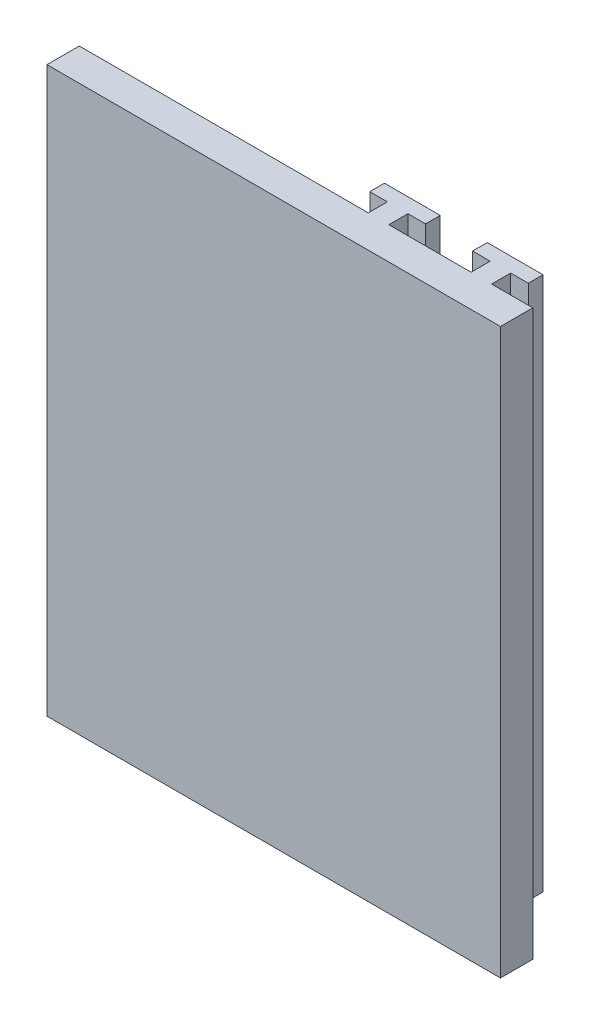
ISO-10303-21;
HEADER;
FILE_DESCRIPTION(('STEP AP214'),'2;1');
FILE_NAME('part.step','',(''),(''),'','','');
FILE_SCHEMA(('AUTOMOTIVE_DESIGN { 1 0 10303 214 1 1 1 1 }'));
ENDSEC;
DATA;
#1=APPLICATION_CONTEXT('core data for automotive mechanical design processes');
#2=APPLICATION_PROTOCOL_DEFINITION('international standard','automotive_design',2000,#1);
#3=PRODUCT_CONTEXT('',#1,'mechanical');
#4=PRODUCT('Part','Part','',(#3));
#5=PRODUCT_RELATED_PRODUCT_CATEGORY('part','',(#4));
#6=PRODUCT_DEFINITION_FORMATION('','',#4);
#7=PRODUCT_DEFINITION_CONTEXT('part definition',#1,'design');
#8=PRODUCT_DEFINITION('design','',#6,#7);
#9=PRODUCT_DEFINITION_SHAPE('','',#8);
#10=(LENGTH_UNIT() NAMED_UNIT(*) SI_UNIT(.MILLI.,.METRE.));
#11=(NAMED_UNIT(*) PLANE_ANGLE_UNIT() SI_UNIT($,.RADIAN.));
#12=(NAMED_UNIT(*) SI_UNIT($,.STERADIAN.) SOLID_ANGLE_UNIT());
#13=UNCERTAINTY_MEASURE_WITH_UNIT(LENGTH_MEASURE(1.E-05),#10,'distance_accuracy_value','');
#14=(GEOMETRIC_REPRESENTATION_CONTEXT(3) GLOBAL_UNCERTAINTY_ASSIGNED_CONTEXT((#13)) GLOBAL_UNIT_ASSIGNED_CONTEXT((#10,
#11,#12)) REPRESENTATION_CONTEXT('',''));
#15=CARTESIAN_POINT('',(0.,0.,0.));
#16=DIRECTION('',(0.,0.,1.));
#17=DIRECTION('',(1.,0.,0.));
#18=AXIS2_PLACEMENT_3D('',#15,#16,#17);
#19=CARTESIAN_POINT('',(0.,0.,133.));
#20=DIRECTION('',(0.,0.,-1.));
#21=DIRECTION('',(-1.,0.,0.));
#22=AXIS2_PLACEMENT_3D('',#19,#20,#21);
#23=PLANE('',#22);
#24=DIRECTION('',(0.,-1.,0.));
#25=VECTOR('',#24,1.);
#26=CARTESIAN_POINT('',(-80.2435786715828,0.,133.));
#27=LINE('',#26,#25);
#28=CARTESIAN_POINT('',(-80.2435786715828,41.7965995852405,133.));
#29=VERTEX_POINT('',#28);
#30=CARTESIAN_POINT('',(-80.2435786715828,-54.2534584342839,133.));
#31=VERTEX_POINT('',#30);
#32=EDGE_CURVE('E50',#29,#31,#27,.T.);
#33=ORIENTED_EDGE('',*,*,#32,.F.);
#34=DIRECTION('',(-1.,0.,0.));
#35=VECTOR('',#34,1.);
#36=CARTESIAN_POINT('',(-3.04970902650446,41.7965995852406,133.));
#37=LINE('',#36,#35);
#38=CARTESIAN_POINT('',(-31.0471979670366,41.7965995852406,133.));
#39=VERTEX_POINT('',#38);
#40=EDGE_CURVE('E320',#39,#29,#37,.T.);
#41=ORIENTED_EDGE('',*,*,#40,.F.);
#42=DIRECTION('',(0.,1.,0.));
#43=VECTOR('',#42,1.);
#44=CARTESIAN_POINT('',(-31.0471979670366,-60.3037204534745,133.));
#45=LINE('',#44,#43);
#46=CARTESIAN_POINT('',(-31.0471979670366,-49.2034004147594,133.));
#47=VERTEX_POINT('',#46);
#48=EDGE_CURVE('E219',#47,#39,#45,.T.);
#49=ORIENTED_EDGE('',*,*,#48,.F.);
#50=DIRECTION('',(1.,0.,0.));
#51=VECTOR('',#50,1.);
#52=CARTESIAN_POINT('',(-31.0471979670366,-49.2034004147594,133.));
#53=LINE('',#52,#51);
#54=CARTESIAN_POINT('',(-27.5522200859723,-49.2034004147594,133.));
#55=VERTEX_POINT('',#54);
#56=EDGE_CURVE('E215',#47,#55,#53,.T.);
#57=ORIENTED_EDGE('',*,*,#56,.T.);
#58=DIRECTION('',(0.,1.,0.));
#59=VECTOR('',#58,1.);
#60=CARTESIAN_POINT('',(-27.5522200859723,-60.3037204534745,133.));
#61=LINE('',#60,#59);
#62=CARTESIAN_POINT('',(-27.5522200859723,41.7965995852406,133.));
#63=VERTEX_POINT('',#62);
#64=EDGE_CURVE('E218',#55,#63,#61,.T.);
#65=ORIENTED_EDGE('',*,*,#64,.T.);
#66=CARTESIAN_POINT('',(-13.5471979670366,41.7965995852406,133.));
#67=VERTEX_POINT('',#66);
#68=EDGE_CURVE('E323',#67,#63,#37,.T.);
#69=ORIENTED_EDGE('',*,*,#68,.F.);
#70=DIRECTION('',(0.,1.,0.));
#71=VECTOR('',#70,1.);
#72=CARTESIAN_POINT('',(-13.5471979670366,-60.3037204534745,133.));
#73=LINE('',#72,#71);
#74=CARTESIAN_POINT('',(-13.5471979670366,-49.2034004147594,133.));
#75=VERTEX_POINT('',#74);
#76=EDGE_CURVE('E282',#75,#67,#73,.T.);
#77=ORIENTED_EDGE('',*,*,#76,.F.);
#78=DIRECTION('',(1.,0.,0.));
#79=VECTOR('',#78,1.);
#80=CARTESIAN_POINT('',(-13.5471979670366,-49.2034004147594,133.));
#81=LINE('',#80,#79);
#82=CARTESIAN_POINT('',(-10.0522200859723,-49.2034004147594,133.));
#83=VERTEX_POINT('',#82);
#84=EDGE_CURVE('E278',#75,#83,#81,.T.);
#85=ORIENTED_EDGE('',*,*,#84,.T.);
#86=DIRECTION('',(0.,1.,0.));
#87=VECTOR('',#86,1.);
#88=CARTESIAN_POINT('',(-10.0522200859723,-60.3037204534745,133.));
#89=LINE('',#88,#87);
#90=CARTESIAN_POINT('',(-10.0522200859723,41.7965995852406,133.));
#91=VERTEX_POINT('',#90);
#92=EDGE_CURVE('E281',#83,#91,#89,.T.);
#93=ORIENTED_EDGE('',*,*,#92,.T.);
#94=CARTESIAN_POINT('',(-3.04970902650446,41.7965995852406,133.));
#95=VERTEX_POINT('',#94);
#96=EDGE_CURVE('E321',#95,#91,#37,.T.);
#97=ORIENTED_EDGE('',*,*,#96,.F.);
#98=DIRECTION('',(0.,1.,0.));
#99=VECTOR('',#98,1.);
#100=CARTESIAN_POINT('',(-3.04970902650446,41.7965995852406,133.));
#101=LINE('',#100,#99);
#102=CARTESIAN_POINT('',(-3.04970902650447,-54.2534584342839,133.));
#103=VERTEX_POINT('',#102);
#104=EDGE_CURVE('E315',#103,#95,#101,.T.);
#105=ORIENTED_EDGE('',*,*,#104,.F.);
#106=DIRECTION('',(1.,0.,0.));
#107=VECTOR('',#106,1.);
#108=CARTESIAN_POINT('',(0.,-54.2534584342839,133.));
#109=LINE('',#108,#107);
#110=EDGE_CURVE('E185',#31,#103,#109,.T.);
#111=ORIENTED_EDGE('',*,*,#110,.F.);
#112=EDGE_LOOP('',(#33,#41,#49,#57,#65,#69,#77,#85,#93,#97,#105,#111));
#113=FACE_BOUND('',#112,.T.);
#114=ADVANCED_FACE('F35',(#113),#23,.T.);
#115=CARTESIAN_POINT('',(-3.04970902650446,41.7965995852406,322.890889145858));
#116=DIRECTION('',(0.,-1.,0.));
#117=DIRECTION('',(1.,0.,0.));
#118=AXIS2_PLACEMENT_3D('',#115,#116,#117);
#119=PLANE('',#118);
#120=ORIENTED_EDGE('',*,*,#40,.T.);
#121=DIRECTION('',(0.,0.,1.));
#122=VECTOR('',#121,1.);
#123=CARTESIAN_POINT('',(-80.2435786715828,41.7965995852405,127.25));
#124=LINE('',#123,#122);
#125=CARTESIAN_POINT('',(-80.2435786715828,41.7965995852405,138.5));
#126=VERTEX_POINT('',#125);
#127=EDGE_CURVE('E181',#29,#126,#124,.T.);
#128=ORIENTED_EDGE('',*,*,#127,.T.);
#129=DIRECTION('',(1.,0.,0.));
#130=VECTOR('',#129,1.);
#131=CARTESIAN_POINT('',(-3.04970902650446,41.7965995852406,138.5));
#132=LINE('',#131,#130);
#133=CARTESIAN_POINT('',(-3.04970902650446,41.7965995852406,138.5));
#134=VERTEX_POINT('',#133);
#135=EDGE_CURVE('E180',#126,#134,#132,.T.);
#136=ORIENTED_EDGE('',*,*,#135,.T.);
#137=DIRECTION('',(0.,0.,-1.));
#138=VECTOR('',#137,1.);
#139=CARTESIAN_POINT('',(-3.04970902650446,41.7965995852406,322.890889145858));
#140=LINE('',#139,#138);
#141=EDGE_CURVE('E317',#134,#95,#140,.T.);
#142=ORIENTED_EDGE('',*,*,#141,.T.);
#143=ORIENTED_EDGE('',*,*,#96,.T.);
#144=DIRECTION('',(0.,0.,-1.));
#145=VECTOR('',#144,1.);
#146=CARTESIAN_POINT('',(-10.0522200859723,41.7965995852406,133.));
#147=LINE('',#146,#145);
#148=CARTESIAN_POINT('',(-10.0522200859723,41.7965995852406,129.75));
#149=VERTEX_POINT('',#148);
#150=EDGE_CURVE('E253',#91,#149,#147,.T.);
#151=ORIENTED_EDGE('',*,*,#150,.T.);
#152=DIRECTION('',(1.,0.,0.));
#153=VECTOR('',#152,1.);
#154=CARTESIAN_POINT('',(-10.0522200859723,41.7965995852406,129.75));
#155=LINE('',#154,#153);
#156=CARTESIAN_POINT('',(-7.05222008597235,41.7965995852406,129.75));
#157=VERTEX_POINT('',#156);
#158=EDGE_CURVE('E270',#149,#157,#155,.T.);
#159=ORIENTED_EDGE('',*,*,#158,.T.);
#160=DIRECTION('',(0.,0.,-1.));
#161=VECTOR('',#160,1.);
#162=CARTESIAN_POINT('',(-7.05222008597235,41.7965995852406,129.75));
#163=LINE('',#162,#161);
#164=CARTESIAN_POINT('',(-7.05222008597235,41.7965995852406,127.25));
#165=VERTEX_POINT('',#164);
#166=EDGE_CURVE('E267',#157,#165,#163,.T.);
#167=ORIENTED_EDGE('',*,*,#166,.T.);
#168=DIRECTION('',(-1.,0.,0.));
#169=VECTOR('',#168,1.);
#170=CARTESIAN_POINT('',(-7.05222008597235,41.7965995852406,127.25));
#171=LINE('',#170,#169);
#172=CARTESIAN_POINT('',(-16.5471979670366,41.7965995852406,127.25));
#173=VERTEX_POINT('',#172);
#174=EDGE_CURVE('E264',#165,#173,#171,.T.);
#175=ORIENTED_EDGE('',*,*,#174,.T.);
#176=DIRECTION('',(0.,0.,1.));
#177=VECTOR('',#176,1.);
#178=CARTESIAN_POINT('',(-16.5471979670366,41.7965995852406,127.25));
#179=LINE('',#178,#177);
#180=CARTESIAN_POINT('',(-16.5471979670366,41.7965995852406,129.75));
#181=VERTEX_POINT('',#180);
#182=EDGE_CURVE('E261',#173,#181,#179,.T.);
#183=ORIENTED_EDGE('',*,*,#182,.T.);
#184=DIRECTION('',(1.,0.,0.));
#185=VECTOR('',#184,1.);
#186=CARTESIAN_POINT('',(-16.5471979670366,41.7965995852406,129.75));
#187=LINE('',#186,#185);
#188=CARTESIAN_POINT('',(-13.5471979670366,41.7965995852406,129.75));
#189=VERTEX_POINT('',#188);
#190=EDGE_CURVE('E258',#181,#189,#187,.T.);
#191=ORIENTED_EDGE('',*,*,#190,.T.);
#192=DIRECTION('',(0.,0.,1.));
#193=VECTOR('',#192,1.);
#194=CARTESIAN_POINT('',(-13.5471979670366,41.7965995852406,129.75));
#195=LINE('',#194,#193);
#196=EDGE_CURVE('E254',#189,#67,#195,.T.);
#197=ORIENTED_EDGE('',*,*,#196,.T.);
#198=ORIENTED_EDGE('',*,*,#68,.T.);
#199=DIRECTION('',(0.,0.,-1.));
#200=VECTOR('',#199,1.);
#201=CARTESIAN_POINT('',(-27.5522200859723,41.7965995852406,133.));
#202=LINE('',#201,#200);
#203=CARTESIAN_POINT('',(-27.5522200859724,41.7965995852406,129.75));
#204=VERTEX_POINT('',#203);
#205=EDGE_CURVE('E191',#63,#204,#202,.T.);
#206=ORIENTED_EDGE('',*,*,#205,.T.);
#207=DIRECTION('',(1.,0.,0.));
#208=VECTOR('',#207,1.);
#209=CARTESIAN_POINT('',(-27.5522200859724,41.7965995852406,129.75));
#210=LINE('',#209,#208);
#211=CARTESIAN_POINT('',(-24.5522200859723,41.7965995852406,129.75));
#212=VERTEX_POINT('',#211);
#213=EDGE_CURVE('E207',#204,#212,#210,.T.);
#214=ORIENTED_EDGE('',*,*,#213,.T.);
#215=DIRECTION('',(0.,0.,-1.));
#216=VECTOR('',#215,1.);
#217=CARTESIAN_POINT('',(-24.5522200859723,41.7965995852406,129.75));
#218=LINE('',#217,#216);
#219=CARTESIAN_POINT('',(-24.5522200859723,41.7965995852406,127.25));
#220=VERTEX_POINT('',#219);
#221=EDGE_CURVE('E204',#212,#220,#218,.T.);
#222=ORIENTED_EDGE('',*,*,#221,.T.);
#223=DIRECTION('',(-1.,0.,0.));
#224=VECTOR('',#223,1.);
#225=CARTESIAN_POINT('',(-24.5522200859723,41.7965995852406,127.25));
#226=LINE('',#225,#224);
#227=CARTESIAN_POINT('',(-34.0471979670366,41.7965995852406,127.25));
#228=VERTEX_POINT('',#227);
#229=EDGE_CURVE('E201',#220,#228,#226,.T.);
#230=ORIENTED_EDGE('',*,*,#229,.T.);
#231=DIRECTION('',(0.,0.,1.));
#232=VECTOR('',#231,1.);
#233=CARTESIAN_POINT('',(-34.0471979670366,41.7965995852406,127.25));
#234=LINE('',#233,#232);
#235=CARTESIAN_POINT('',(-34.0471979670366,41.7965995852406,129.75));
#236=VERTEX_POINT('',#235);
#237=EDGE_CURVE('E198',#228,#236,#234,.T.);
#238=ORIENTED_EDGE('',*,*,#237,.T.);
#239=DIRECTION('',(1.,0.,0.));
#240=VECTOR('',#239,1.);
#241=CARTESIAN_POINT('',(-34.0471979670366,41.7965995852406,129.75));
#242=LINE('',#241,#240);
#243=CARTESIAN_POINT('',(-31.0471979670366,41.7965995852406,129.75));
#244=VERTEX_POINT('',#243);
#245=EDGE_CURVE('E195',#236,#244,#242,.T.);
#246=ORIENTED_EDGE('',*,*,#245,.T.);
#247=DIRECTION('',(0.,0.,1.));
#248=VECTOR('',#247,1.);
#249=CARTESIAN_POINT('',(-31.0471979670366,41.7965995852406,129.75));
#250=LINE('',#249,#248);
#251=EDGE_CURVE('E192',#244,#39,#250,.T.);
#252=ORIENTED_EDGE('',*,*,#251,.T.);
#253=EDGE_LOOP('',(#120,#128,#136,#142,#143,#151,#159,#167,#175,#183,#191,#197,#198,#206,#214,
#222,#230,#238,#246,#252));
#254=FACE_BOUND('',#253,.T.);
#255=ADVANCED_FACE('F329',(#254),#119,.F.);
#256=CARTESIAN_POINT('',(-3.04970902650446,41.7965995852406,322.890889145858));
#257=DIRECTION('',(-1.,0.,0.));
#258=DIRECTION('',(0.,-1.,0.));
#259=AXIS2_PLACEMENT_3D('',#256,#257,#258);
#260=PLANE('',#259);
#261=DIRECTION('',(0.,-1.,0.));
#262=VECTOR('',#261,1.);
#263=CARTESIAN_POINT('',(-3.04970902650446,41.7965995852406,138.5));
#264=LINE('',#263,#262);
#265=CARTESIAN_POINT('',(-3.04970902650447,-54.2534584342839,138.5));
#266=VERTEX_POINT('',#265);
#267=EDGE_CURVE('E43',#134,#266,#264,.T.);
#268=ORIENTED_EDGE('',*,*,#267,.T.);
#269=DIRECTION('',(0.,0.,1.));
#270=VECTOR('',#269,1.);
#271=CARTESIAN_POINT('',(-3.04970902650447,-54.2534584342839,128.5));
#272=LINE('',#271,#270);
#273=EDGE_CURVE('E57',#103,#266,#272,.T.);
#274=ORIENTED_EDGE('',*,*,#273,.F.);
#275=ORIENTED_EDGE('',*,*,#104,.T.);
#276=ORIENTED_EDGE('',*,*,#141,.F.);
#277=EDGE_LOOP('',(#268,#274,#275,#276));
#278=FACE_BOUND('',#277,.T.);
#279=ADVANCED_FACE('F37',(#278),#260,.F.);
#280=CARTESIAN_POINT('',(39.9502909734955,-6.20340041475944,138.5));
#281=DIRECTION('',(0.,0.,-1.));
#282=DIRECTION('',(-1.,0.,0.));
#283=AXIS2_PLACEMENT_3D('',#280,#281,#282);
#284=PLANE('',#283);
#285=ORIENTED_EDGE('',*,*,#135,.F.);
#286=DIRECTION('',(0.,1.,0.));
#287=VECTOR('',#286,1.);
#288=CARTESIAN_POINT('',(-80.2435786715828,41.7965995852405,138.5));
#289=LINE('',#288,#287);
#290=CARTESIAN_POINT('',(-80.2435786715828,-54.2534584342839,138.5));
#291=VERTEX_POINT('',#290);
#292=EDGE_CURVE('E171',#291,#126,#289,.T.);
#293=ORIENTED_EDGE('',*,*,#292,.F.);
#294=DIRECTION('',(-1.,0.,0.));
#295=VECTOR('',#294,1.);
#296=CARTESIAN_POINT('',(-123.049709026504,-54.2534584342839,138.5));
#297=LINE('',#296,#295);
#298=EDGE_CURVE('E178',#266,#291,#297,.T.);
#299=ORIENTED_EDGE('',*,*,#298,.F.);
#300=ORIENTED_EDGE('',*,*,#267,.F.);
#301=EDGE_LOOP('',(#285,#293,#299,#300));
#302=FACE_BOUND('',#301,.T.);
#303=ADVANCED_FACE('F176',(#302),#284,.F.);
#304=CARTESIAN_POINT('',(-3.04970902650446,-49.2034004147594,123.));
#305=DIRECTION('',(0.,-1.,0.));
#306=DIRECTION('',(0.,0.,-1.));
#307=AXIS2_PLACEMENT_3D('',#304,#305,#306);
#308=PLANE('',#307);
#309=ORIENTED_EDGE('',*,*,#84,.F.);
#310=DIRECTION('',(0.,0.,1.));
#311=VECTOR('',#310,1.);
#312=CARTESIAN_POINT('',(-13.5471979670366,-49.2034004147594,129.75));
#313=LINE('',#312,#311);
#314=CARTESIAN_POINT('',(-13.5471979670366,-49.2034004147594,129.75));
#315=VERTEX_POINT('',#314);
#316=EDGE_CURVE('E283',#315,#75,#313,.T.);
#317=ORIENTED_EDGE('',*,*,#316,.F.);
#318=DIRECTION('',(1.,0.,0.));
#319=VECTOR('',#318,1.);
#320=CARTESIAN_POINT('',(-16.5471979670366,-49.2034004147594,129.75));
#321=LINE('',#320,#319);
#322=CARTESIAN_POINT('',(-16.5471979670366,-49.2034004147594,129.75));
#323=VERTEX_POINT('',#322);
#324=EDGE_CURVE('E287',#323,#315,#321,.T.);
#325=ORIENTED_EDGE('',*,*,#324,.F.);
#326=DIRECTION('',(0.,0.,1.));
#327=VECTOR('',#326,1.);
#328=CARTESIAN_POINT('',(-16.5471979670366,-49.2034004147594,127.25));
#329=LINE('',#328,#327);
#330=CARTESIAN_POINT('',(-16.5471979670366,-49.2034004147594,127.25));
#331=VERTEX_POINT('',#330);
#332=EDGE_CURVE('E291',#331,#323,#329,.T.);
#333=ORIENTED_EDGE('',*,*,#332,.F.);
#334=DIRECTION('',(-1.,0.,0.));
#335=VECTOR('',#334,1.);
#336=CARTESIAN_POINT('',(-7.05222008597234,-49.2034004147594,127.25));
#337=LINE('',#336,#335);
#338=CARTESIAN_POINT('',(-7.05222008597234,-49.2034004147594,127.25));
#339=VERTEX_POINT('',#338);
#340=EDGE_CURVE('E295',#339,#331,#337,.T.);
#341=ORIENTED_EDGE('',*,*,#340,.F.);
#342=DIRECTION('',(0.,0.,-1.));
#343=VECTOR('',#342,1.);
#344=CARTESIAN_POINT('',(-7.05222008597234,-49.2034004147594,129.75));
#345=LINE('',#344,#343);
#346=CARTESIAN_POINT('',(-7.05222008597234,-49.2034004147594,129.75));
#347=VERTEX_POINT('',#346);
#348=EDGE_CURVE('E299',#347,#339,#345,.T.);
#349=ORIENTED_EDGE('',*,*,#348,.F.);
#350=DIRECTION('',(1.,0.,0.));
#351=VECTOR('',#350,1.);
#352=CARTESIAN_POINT('',(-10.0522200859723,-49.2034004147594,129.75));
#353=LINE('',#352,#351);
#354=CARTESIAN_POINT('',(-10.0522200859723,-49.2034004147594,129.75));
#355=VERTEX_POINT('',#354);
#356=EDGE_CURVE('E303',#355,#347,#353,.T.);
#357=ORIENTED_EDGE('',*,*,#356,.F.);
#358=DIRECTION('',(0.,0.,-1.));
#359=VECTOR('',#358,1.);
#360=CARTESIAN_POINT('',(-10.0522200859723,-49.2034004147594,133.));
#361=LINE('',#360,#359);
#362=EDGE_CURVE('E257',#83,#355,#361,.T.);
#363=ORIENTED_EDGE('',*,*,#362,.F.);
#364=EDGE_LOOP('',(#309,#317,#325,#333,#341,#349,#357,#363));
#365=FACE_BOUND('',#364,.T.);
#366=ADVANCED_FACE('F373',(#365),#308,.T.);
#367=CARTESIAN_POINT('',(-10.0522200859723,-60.3037204534745,133.));
#368=DIRECTION('',(1.,0.,0.));
#369=DIRECTION('',(0.,1.,0.));
#370=AXIS2_PLACEMENT_3D('',#367,#368,#369);
#371=PLANE('',#370);
#372=ORIENTED_EDGE('',*,*,#92,.F.);
#373=ORIENTED_EDGE('',*,*,#362,.T.);
#374=DIRECTION('',(0.,1.,0.));
#375=VECTOR('',#374,1.);
#376=CARTESIAN_POINT('',(-10.0522200859723,-60.3037204534745,129.75));
#377=LINE('',#376,#375);
#378=EDGE_CURVE('E277',#355,#149,#377,.T.);
#379=ORIENTED_EDGE('',*,*,#378,.T.);
#380=ORIENTED_EDGE('',*,*,#150,.F.);
#381=EDGE_LOOP('',(#372,#373,#379,#380));
#382=FACE_BOUND('',#381,.T.);
#383=ADVANCED_FACE('F336',(#382),#371,.T.);
#384=CARTESIAN_POINT('',(-10.0522200859723,-60.3037204534745,129.75));
#385=DIRECTION('',(0.,0.,1.));
#386=DIRECTION('',(1.,0.,0.));
#387=AXIS2_PLACEMENT_3D('',#384,#385,#386);
#388=PLANE('',#387);
#389=ORIENTED_EDGE('',*,*,#378,.F.);
#390=ORIENTED_EDGE('',*,*,#356,.T.);
#391=DIRECTION('',(0.,1.,0.));
#392=VECTOR('',#391,1.);
#393=CARTESIAN_POINT('',(-7.05222008597234,-60.3037204534745,129.75));
#394=LINE('',#393,#392);
#395=EDGE_CURVE('E302',#347,#157,#394,.T.);
#396=ORIENTED_EDGE('',*,*,#395,.T.);
#397=ORIENTED_EDGE('',*,*,#158,.F.);
#398=EDGE_LOOP('',(#389,#390,#396,#397));
#399=FACE_BOUND('',#398,.T.);
#400=ADVANCED_FACE('F341',(#399),#388,.T.);
#401=CARTESIAN_POINT('',(-7.05222008597234,-60.3037204534745,129.75));
#402=DIRECTION('',(1.,0.,0.));
#403=DIRECTION('',(0.,1.,0.));
#404=AXIS2_PLACEMENT_3D('',#401,#402,#403);
#405=PLANE('',#404);
#406=ORIENTED_EDGE('',*,*,#395,.F.);
#407=ORIENTED_EDGE('',*,*,#348,.T.);
#408=DIRECTION('',(0.,1.,0.));
#409=VECTOR('',#408,1.);
#410=CARTESIAN_POINT('',(-7.05222008597234,-60.3037204534745,127.25));
#411=LINE('',#410,#409);
#412=EDGE_CURVE('E298',#339,#165,#411,.T.);
#413=ORIENTED_EDGE('',*,*,#412,.T.);
#414=ORIENTED_EDGE('',*,*,#166,.F.);
#415=EDGE_LOOP('',(#406,#407,#413,#414));
#416=FACE_BOUND('',#415,.T.);
#417=ADVANCED_FACE('F344',(#416),#405,.T.);
#418=CARTESIAN_POINT('',(-7.05222008597234,-60.3037204534745,127.25));
#419=DIRECTION('',(0.,0.,-1.));
#420=DIRECTION('',(-1.,0.,0.));
#421=AXIS2_PLACEMENT_3D('',#418,#419,#420);
#422=PLANE('',#421);
#423=ORIENTED_EDGE('',*,*,#412,.F.);
#424=ORIENTED_EDGE('',*,*,#340,.T.);
#425=DIRECTION('',(0.,1.,0.));
#426=VECTOR('',#425,1.);
#427=CARTESIAN_POINT('',(-16.5471979670366,-60.3037204534745,127.25));
#428=LINE('',#427,#426);
#429=EDGE_CURVE('E294',#331,#173,#428,.T.);
#430=ORIENTED_EDGE('',*,*,#429,.T.);
#431=ORIENTED_EDGE('',*,*,#174,.F.);
#432=EDGE_LOOP('',(#423,#424,#430,#431));
#433=FACE_BOUND('',#432,.T.);
#434=ADVANCED_FACE('F348',(#433),#422,.T.);
#435=CARTESIAN_POINT('',(-16.5471979670366,-60.3037204534745,127.25));
#436=DIRECTION('',(-1.,0.,0.));
#437=DIRECTION('',(0.,-1.,0.));
#438=AXIS2_PLACEMENT_3D('',#435,#436,#437);
#439=PLANE('',#438);
#440=ORIENTED_EDGE('',*,*,#429,.F.);
#441=ORIENTED_EDGE('',*,*,#332,.T.);
#442=DIRECTION('',(0.,1.,0.));
#443=VECTOR('',#442,1.);
#444=CARTESIAN_POINT('',(-16.5471979670366,-60.3037204534745,129.75));
#445=LINE('',#444,#443);
#446=EDGE_CURVE('E290',#323,#181,#445,.T.);
#447=ORIENTED_EDGE('',*,*,#446,.T.);
#448=ORIENTED_EDGE('',*,*,#182,.F.);
#449=EDGE_LOOP('',(#440,#441,#447,#448));
#450=FACE_BOUND('',#449,.T.);
#451=ADVANCED_FACE('F354',(#450),#439,.T.);
#452=CARTESIAN_POINT('',(-16.5471979670366,-60.3037204534745,129.75));
#453=DIRECTION('',(0.,0.,1.));
#454=DIRECTION('',(1.,0.,0.));
#455=AXIS2_PLACEMENT_3D('',#452,#453,#454);
#456=PLANE('',#455);
#457=ORIENTED_EDGE('',*,*,#446,.F.);
#458=ORIENTED_EDGE('',*,*,#324,.T.);
#459=DIRECTION('',(0.,1.,0.));
#460=VECTOR('',#459,1.);
#461=CARTESIAN_POINT('',(-13.5471979670366,-60.3037204534745,129.75));
#462=LINE('',#461,#460);
#463=EDGE_CURVE('E286',#315,#189,#462,.T.);
#464=ORIENTED_EDGE('',*,*,#463,.T.);
#465=ORIENTED_EDGE('',*,*,#190,.F.);
#466=EDGE_LOOP('',(#457,#458,#464,#465));
#467=FACE_BOUND('',#466,.T.);
#468=ADVANCED_FACE('F357',(#467),#456,.T.);
#469=CARTESIAN_POINT('',(-13.5471979670366,-60.3037204534745,129.75));
#470=DIRECTION('',(-1.,0.,0.));
#471=DIRECTION('',(0.,0.,1.));
#472=AXIS2_PLACEMENT_3D('',#469,#470,#471);
#473=PLANE('',#472);
#474=ORIENTED_EDGE('',*,*,#463,.F.);
#475=ORIENTED_EDGE('',*,*,#316,.T.);
#476=ORIENTED_EDGE('',*,*,#76,.T.);
#477=ORIENTED_EDGE('',*,*,#196,.F.);
#478=EDGE_LOOP('',(#474,#475,#476,#477));
#479=FACE_BOUND('',#478,.T.);
#480=ADVANCED_FACE('F360',(#479),#473,.T.);
#481=CARTESIAN_POINT('',(-3.04970902650446,-49.2034004147594,123.));
#482=DIRECTION('',(0.,-1.,0.));
#483=DIRECTION('',(0.,0.,-1.));
#484=AXIS2_PLACEMENT_3D('',#481,#482,#483);
#485=PLANE('',#484);
#486=ORIENTED_EDGE('',*,*,#56,.F.);
#487=DIRECTION('',(0.,0.,1.));
#488=VECTOR('',#487,1.);
#489=CARTESIAN_POINT('',(-31.0471979670366,-49.2034004147594,129.75));
#490=LINE('',#489,#488);
#491=CARTESIAN_POINT('',(-31.0471979670366,-49.2034004147594,129.75));
#492=VERTEX_POINT('',#491);
#493=EDGE_CURVE('E220',#492,#47,#490,.T.);
#494=ORIENTED_EDGE('',*,*,#493,.F.);
#495=DIRECTION('',(1.,0.,0.));
#496=VECTOR('',#495,1.);
#497=CARTESIAN_POINT('',(-34.0471979670366,-49.2034004147594,129.75));
#498=LINE('',#497,#496);
#499=CARTESIAN_POINT('',(-34.0471979670366,-49.2034004147594,129.75));
#500=VERTEX_POINT('',#499);
#501=EDGE_CURVE('E224',#500,#492,#498,.T.);
#502=ORIENTED_EDGE('',*,*,#501,.F.);
#503=DIRECTION('',(0.,0.,1.));
#504=VECTOR('',#503,1.);
#505=CARTESIAN_POINT('',(-34.0471979670366,-49.2034004147594,127.25));
#506=LINE('',#505,#504);
#507=CARTESIAN_POINT('',(-34.0471979670366,-49.2034004147594,127.25));
#508=VERTEX_POINT('',#507);
#509=EDGE_CURVE('E228',#508,#500,#506,.T.);
#510=ORIENTED_EDGE('',*,*,#509,.F.);
#511=DIRECTION('',(-1.,0.,0.));
#512=VECTOR('',#511,1.);
#513=CARTESIAN_POINT('',(-24.5522200859723,-49.2034004147594,127.25));
#514=LINE('',#513,#512);
#515=CARTESIAN_POINT('',(-24.5522200859723,-49.2034004147594,127.25));
#516=VERTEX_POINT('',#515);
#517=EDGE_CURVE('E232',#516,#508,#514,.T.);
#518=ORIENTED_EDGE('',*,*,#517,.F.);
#519=DIRECTION('',(0.,0.,-1.));
#520=VECTOR('',#519,1.);
#521=CARTESIAN_POINT('',(-24.5522200859723,-49.2034004147594,129.75));
#522=LINE('',#521,#520);
#523=CARTESIAN_POINT('',(-24.5522200859723,-49.2034004147594,129.75));
#524=VERTEX_POINT('',#523);
#525=EDGE_CURVE('E236',#524,#516,#522,.T.);
#526=ORIENTED_EDGE('',*,*,#525,.F.);
#527=DIRECTION('',(1.,0.,0.));
#528=VECTOR('',#527,1.);
#529=CARTESIAN_POINT('',(-27.5522200859724,-49.2034004147594,129.75));
#530=LINE('',#529,#528);
#531=CARTESIAN_POINT('',(-27.5522200859724,-49.2034004147594,129.75));
#532=VERTEX_POINT('',#531);
#533=EDGE_CURVE('E240',#532,#524,#530,.T.);
#534=ORIENTED_EDGE('',*,*,#533,.F.);
#535=DIRECTION('',(0.,0.,-1.));
#536=VECTOR('',#535,1.);
#537=CARTESIAN_POINT('',(-27.5522200859723,-49.2034004147594,133.));
#538=LINE('',#537,#536);
#539=EDGE_CURVE('E194',#55,#532,#538,.T.);
#540=ORIENTED_EDGE('',*,*,#539,.F.);
#541=EDGE_LOOP('',(#486,#494,#502,#510,#518,#526,#534,#540));
#542=FACE_BOUND('',#541,.T.);
#543=ADVANCED_FACE('F398',(#542),#485,.T.);
#544=CARTESIAN_POINT('',(-27.5522200859723,-60.3037204534745,133.));
#545=DIRECTION('',(1.,0.,0.));
#546=DIRECTION('',(0.,0.,-1.));
#547=AXIS2_PLACEMENT_3D('',#544,#545,#546);
#548=PLANE('',#547);
#549=ORIENTED_EDGE('',*,*,#64,.F.);
#550=ORIENTED_EDGE('',*,*,#539,.T.);
#551=DIRECTION('',(0.,1.,0.));
#552=VECTOR('',#551,1.);
#553=CARTESIAN_POINT('',(-27.5522200859724,-60.3037204534745,129.75));
#554=LINE('',#553,#552);
#555=EDGE_CURVE('E214',#532,#204,#554,.T.);
#556=ORIENTED_EDGE('',*,*,#555,.T.);
#557=ORIENTED_EDGE('',*,*,#205,.F.);
#558=EDGE_LOOP('',(#549,#550,#556,#557));
#559=FACE_BOUND('',#558,.T.);
#560=ADVANCED_FACE('F401',(#559),#548,.T.);
#561=CARTESIAN_POINT('',(-27.5522200859724,-60.3037204534745,129.75));
#562=DIRECTION('',(0.,0.,1.));
#563=DIRECTION('',(1.,0.,0.));
#564=AXIS2_PLACEMENT_3D('',#561,#562,#563);
#565=PLANE('',#564);
#566=ORIENTED_EDGE('',*,*,#555,.F.);
#567=ORIENTED_EDGE('',*,*,#533,.T.);
#568=DIRECTION('',(0.,1.,0.));
#569=VECTOR('',#568,1.);
#570=CARTESIAN_POINT('',(-24.5522200859723,-60.3037204534745,129.75));
#571=LINE('',#570,#569);
#572=EDGE_CURVE('E239',#524,#212,#571,.T.);
#573=ORIENTED_EDGE('',*,*,#572,.T.);
#574=ORIENTED_EDGE('',*,*,#213,.F.);
#575=EDGE_LOOP('',(#566,#567,#573,#574));
#576=FACE_BOUND('',#575,.T.);
#577=ADVANCED_FACE('F405',(#576),#565,.T.);
#578=CARTESIAN_POINT('',(-24.5522200859723,-60.3037204534745,129.75));
#579=DIRECTION('',(1.,0.,0.));
#580=DIRECTION('',(0.,1.,0.));
#581=AXIS2_PLACEMENT_3D('',#578,#579,#580);
#582=PLANE('',#581);
#583=ORIENTED_EDGE('',*,*,#572,.F.);
#584=ORIENTED_EDGE('',*,*,#525,.T.);
#585=DIRECTION('',(0.,1.,0.));
#586=VECTOR('',#585,1.);
#587=CARTESIAN_POINT('',(-24.5522200859723,-60.3037204534745,127.25));
#588=LINE('',#587,#586);
#589=EDGE_CURVE('E235',#516,#220,#588,.T.);
#590=ORIENTED_EDGE('',*,*,#589,.T.);
#591=ORIENTED_EDGE('',*,*,#221,.F.);
#592=EDGE_LOOP('',(#583,#584,#590,#591));
#593=FACE_BOUND('',#592,.T.);
#594=ADVANCED_FACE('F409',(#593),#582,.T.);
#595=CARTESIAN_POINT('',(-24.5522200859723,-60.3037204534745,127.25));
#596=DIRECTION('',(0.,0.,-1.));
#597=DIRECTION('',(-1.,0.,0.));
#598=AXIS2_PLACEMENT_3D('',#595,#596,#597);
#599=PLANE('',#598);
#600=ORIENTED_EDGE('',*,*,#589,.F.);
#601=ORIENTED_EDGE('',*,*,#517,.T.);
#602=DIRECTION('',(0.,1.,0.));
#603=VECTOR('',#602,1.);
#604=CARTESIAN_POINT('',(-34.0471979670366,-60.3037204534745,127.25));
#605=LINE('',#604,#603);
#606=EDGE_CURVE('E231',#508,#228,#605,.T.);
#607=ORIENTED_EDGE('',*,*,#606,.T.);
#608=ORIENTED_EDGE('',*,*,#229,.F.);
#609=EDGE_LOOP('',(#600,#601,#607,#608));
#610=FACE_BOUND('',#609,.T.);
#611=ADVANCED_FACE('F413',(#610),#599,.T.);
#612=CARTESIAN_POINT('',(-34.0471979670366,-60.3037204534745,127.25));
#613=DIRECTION('',(-1.,0.,0.));
#614=DIRECTION('',(0.,-1.,0.));
#615=AXIS2_PLACEMENT_3D('',#612,#613,#614);
#616=PLANE('',#615);
#617=ORIENTED_EDGE('',*,*,#606,.F.);
#618=ORIENTED_EDGE('',*,*,#509,.T.);
#619=DIRECTION('',(0.,1.,0.));
#620=VECTOR('',#619,1.);
#621=CARTESIAN_POINT('',(-34.0471979670366,-60.3037204534745,129.75));
#622=LINE('',#621,#620);
#623=EDGE_CURVE('E227',#500,#236,#622,.T.);
#624=ORIENTED_EDGE('',*,*,#623,.T.);
#625=ORIENTED_EDGE('',*,*,#237,.F.);
#626=EDGE_LOOP('',(#617,#618,#624,#625));
#627=FACE_BOUND('',#626,.T.);
#628=ADVANCED_FACE('F417',(#627),#616,.T.);
#629=CARTESIAN_POINT('',(-34.0471979670366,-60.3037204534745,129.75));
#630=DIRECTION('',(0.,0.,1.));
#631=DIRECTION('',(1.,0.,0.));
#632=AXIS2_PLACEMENT_3D('',#629,#630,#631);
#633=PLANE('',#632);
#634=ORIENTED_EDGE('',*,*,#623,.F.);
#635=ORIENTED_EDGE('',*,*,#501,.T.);
#636=DIRECTION('',(0.,1.,0.));
#637=VECTOR('',#636,1.);
#638=CARTESIAN_POINT('',(-31.0471979670366,-60.3037204534745,129.75));
#639=LINE('',#638,#637);
#640=EDGE_CURVE('E223',#492,#244,#639,.T.);
#641=ORIENTED_EDGE('',*,*,#640,.T.);
#642=ORIENTED_EDGE('',*,*,#245,.F.);
#643=EDGE_LOOP('',(#634,#635,#641,#642));
#644=FACE_BOUND('',#643,.T.);
#645=ADVANCED_FACE('F421',(#644),#633,.T.);
#646=CARTESIAN_POINT('',(-31.0471979670366,-60.3037204534745,129.75));
#647=DIRECTION('',(-1.,0.,0.));
#648=DIRECTION('',(0.,-1.,0.));
#649=AXIS2_PLACEMENT_3D('',#646,#647,#648);
#650=PLANE('',#649);
#651=ORIENTED_EDGE('',*,*,#640,.F.);
#652=ORIENTED_EDGE('',*,*,#493,.T.);
#653=ORIENTED_EDGE('',*,*,#48,.T.);
#654=ORIENTED_EDGE('',*,*,#251,.F.);
#655=EDGE_LOOP('',(#651,#652,#653,#654));
#656=FACE_BOUND('',#655,.T.);
#657=ADVANCED_FACE('F425',(#656),#650,.T.);
#658=CARTESIAN_POINT('',(-123.049709026504,-54.2534584342839,128.5));
#659=DIRECTION('',(0.,1.,0.));
#660=DIRECTION('',(0.,0.,1.));
#661=AXIS2_PLACEMENT_3D('',#658,#659,#660);
#662=PLANE('',#661);
#663=ORIENTED_EDGE('',*,*,#298,.T.);
#664=DIRECTION('',(0.,0.,-1.));
#665=VECTOR('',#664,1.);
#666=CARTESIAN_POINT('',(-80.2435786715828,-54.2534584342839,128.5));
#667=LINE('',#666,#665);
#668=EDGE_CURVE('E11',#291,#31,#667,.T.);
#669=ORIENTED_EDGE('',*,*,#668,.T.);
#670=ORIENTED_EDGE('',*,*,#110,.T.);
#671=ORIENTED_EDGE('',*,*,#273,.T.);
#672=EDGE_LOOP('',(#663,#669,#670,#671));
#673=FACE_BOUND('',#672,.T.);
#674=ADVANCED_FACE('F183',(#673),#662,.F.);
#675=CARTESIAN_POINT('',(-80.2435786715828,41.7965995852405,127.25));
#676=DIRECTION('',(1.,0.,0.));
#677=DIRECTION('',(0.,0.,-1.));
#678=AXIS2_PLACEMENT_3D('',#675,#676,#677);
#679=PLANE('',#678);
#680=ORIENTED_EDGE('',*,*,#32,.T.);
#681=ORIENTED_EDGE('',*,*,#668,.F.);
#682=ORIENTED_EDGE('',*,*,#292,.T.);
#683=ORIENTED_EDGE('',*,*,#127,.F.);
#684=EDGE_LOOP('',(#680,#681,#682,#683));
#685=FACE_BOUND('',#684,.T.);
#686=ADVANCED_FACE('F170',(#685),#679,.F.);
#687=CLOSED_SHELL('',(#114,#255,#279,#303,#366,#383,#400,#417,#434,#451,#468,#480,#543,#560,
#577,#594,#611,#628,#645,#657,#674,#686));
#688=MANIFOLD_SOLID_BREP('B2',#687);
#689=ADVANCED_BREP_SHAPE_REPRESENTATION('',(#18,#688),#14);
#690=SHAPE_DEFINITION_REPRESENTATION(#9,#689);
ENDSEC;
END-ISO-10303-21;
